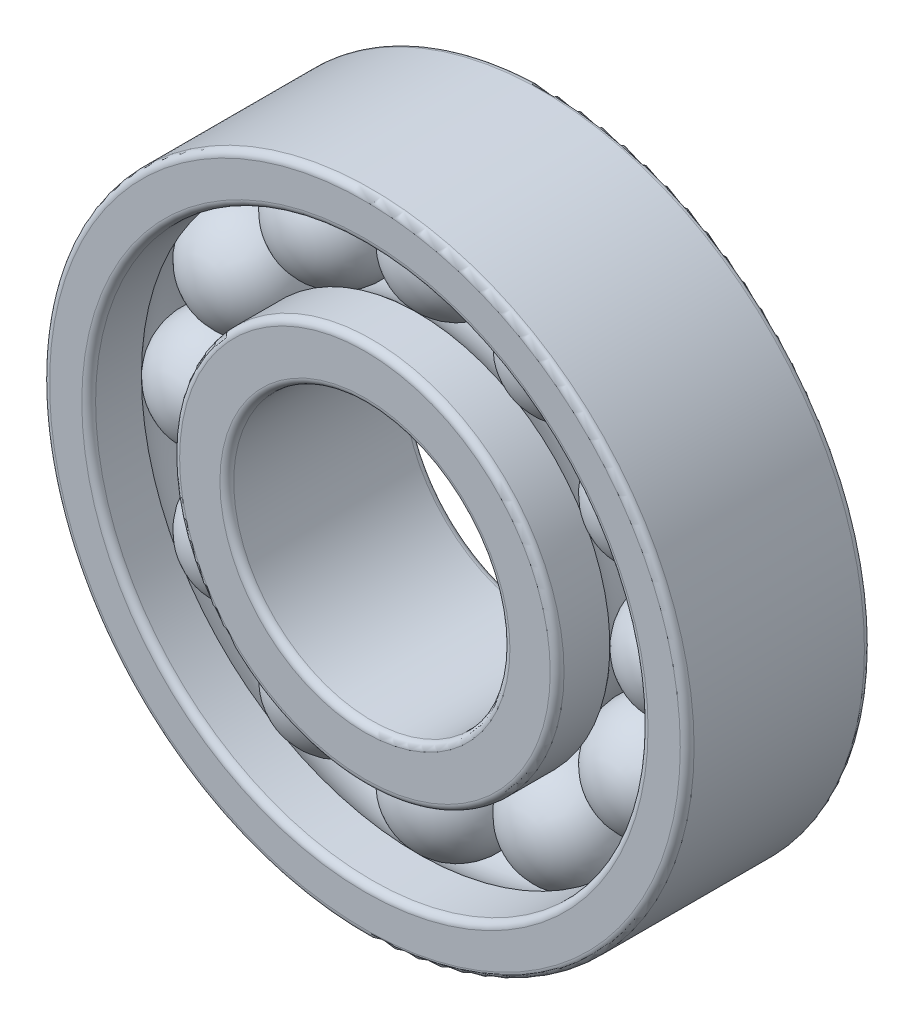
ISO-10303-21;
HEADER;
FILE_DESCRIPTION(('STEP AP214'),'2;1');
FILE_NAME('part.step','',(''),(''),'','','');
FILE_SCHEMA(('AUTOMOTIVE_DESIGN { 1 0 10303 214 1 1 1 1 }'));
ENDSEC;
DATA;
#1=APPLICATION_CONTEXT('core data for automotive mechanical design processes');
#2=APPLICATION_PROTOCOL_DEFINITION('international standard','automotive_design',2000,#1);
#3=PRODUCT_CONTEXT('',#1,'mechanical');
#4=PRODUCT('Part','Part','',(#3));
#5=PRODUCT_RELATED_PRODUCT_CATEGORY('part','',(#4));
#6=PRODUCT_DEFINITION_FORMATION('','',#4);
#7=PRODUCT_DEFINITION_CONTEXT('part definition',#1,'design');
#8=PRODUCT_DEFINITION('design','',#6,#7);
#9=PRODUCT_DEFINITION_SHAPE('','',#8);
#10=(LENGTH_UNIT() NAMED_UNIT(*) SI_UNIT(.MILLI.,.METRE.));
#11=(NAMED_UNIT(*) PLANE_ANGLE_UNIT() SI_UNIT($,.RADIAN.));
#12=(NAMED_UNIT(*) SI_UNIT($,.STERADIAN.) SOLID_ANGLE_UNIT());
#13=UNCERTAINTY_MEASURE_WITH_UNIT(LENGTH_MEASURE(1.E-05),#10,'distance_accuracy_value','');
#14=(GEOMETRIC_REPRESENTATION_CONTEXT(3) GLOBAL_UNCERTAINTY_ASSIGNED_CONTEXT((#13)) GLOBAL_UNIT_ASSIGNED_CONTEXT((#10,
#11,#12)) REPRESENTATION_CONTEXT('',''));
#15=CARTESIAN_POINT('',(0.,0.,0.));
#16=DIRECTION('',(0.,0.,1.));
#17=DIRECTION('',(1.,0.,0.));
#18=AXIS2_PLACEMENT_3D('',#15,#16,#17);
#19=CARTESIAN_POINT('',(-8.81180848350673,5.08749999999989,4.));
#20=DIRECTION('',(0.,0.,-1.));
#21=DIRECTION('',(0.866025403784445,-0.499999999999989,0.));
#22=AXIS2_PLACEMENT_3D('',#19,#20,#21);
#23=SPHERICAL_SURFACE('',#22,2.5);
#24=CARTESIAN_POINT('',(-8.81180848350673,5.08749999999989,1.5));
#25=VERTEX_POINT('',#24);
#26=VERTEX_LOOP('',#25);
#27=FACE_BOUND('',#26,.T.);
#28=ADVANCED_FACE('F76',(#27),#23,.T.);
#29=CLOSED_SHELL('',(#28));
#30=MANIFOLD_SOLID_BREP('B2',#29);
#31=CARTESIAN_POINT('',(-5.0875000000001,8.8118084835066,4.));
#32=DIRECTION('',(0.,0.,-1.));
#33=DIRECTION('',(0.50000000000001,-0.866025403784433,0.));
#34=AXIS2_PLACEMENT_3D('',#31,#32,#33);
#35=SPHERICAL_SURFACE('',#34,2.5);
#36=CARTESIAN_POINT('',(-5.0875000000001,8.8118084835066,1.5));
#37=VERTEX_POINT('',#36);
#38=VERTEX_LOOP('',#37);
#39=FACE_BOUND('',#38,.T.);
#40=ADVANCED_FACE('F95',(#39),#35,.T.);
#41=CLOSED_SHELL('',(#40));
#42=MANIFOLD_SOLID_BREP('B7',#41);
#43=CARTESIAN_POINT('',(-1.06577529597864E-13,10.175,4.));
#44=DIRECTION('',(0.,0.,-1.));
#45=DIRECTION('',(0.,-1.,0.));
#46=AXIS2_PLACEMENT_3D('',#43,#44,#45);
#47=SPHERICAL_SURFACE('',#46,2.5);
#48=CARTESIAN_POINT('',(-1.06577529597864E-13,10.175,1.5));
#49=VERTEX_POINT('',#48);
#50=VERTEX_LOOP('',#49);
#51=FACE_BOUND('',#50,.T.);
#52=ADVANCED_FACE('F114',(#51),#47,.T.);
#53=CLOSED_SHELL('',(#52));
#54=MANIFOLD_SOLID_BREP('B72',#53);
#55=CARTESIAN_POINT('',(5.08749999999992,8.81180848350671,4.));
#56=DIRECTION('',(0.,0.,-1.));
#57=DIRECTION('',(-0.499999999999992,-0.866025403784443,0.));
#58=AXIS2_PLACEMENT_3D('',#55,#56,#57);
#59=SPHERICAL_SURFACE('',#58,2.5);
#60=CARTESIAN_POINT('',(5.08749999999992,8.81180848350671,1.5));
#61=VERTEX_POINT('',#60);
#62=VERTEX_LOOP('',#61);
#63=FACE_BOUND('',#62,.T.);
#64=ADVANCED_FACE('F133',(#63),#59,.T.);
#65=CLOSED_SHELL('',(#64));
#66=MANIFOLD_SOLID_BREP('B91',#65);
#67=CARTESIAN_POINT('',(8.81180848350662,5.08750000000007,4.));
#68=DIRECTION('',(0.,0.,-1.));
#69=DIRECTION('',(-0.866025403784435,-0.500000000000007,0.));
#70=AXIS2_PLACEMENT_3D('',#67,#68,#69);
#71=SPHERICAL_SURFACE('',#70,2.5);
#72=CARTESIAN_POINT('',(8.81180848350662,5.08750000000007,1.5));
#73=VERTEX_POINT('',#72);
#74=VERTEX_LOOP('',#73);
#75=FACE_BOUND('',#74,.T.);
#76=ADVANCED_FACE('F152',(#75),#71,.T.);
#77=CLOSED_SHELL('',(#76));
#78=MANIFOLD_SOLID_BREP('B110',#77);
#79=CARTESIAN_POINT('',(10.175,0.,4.));
#80=DIRECTION('',(0.,0.,-1.));
#81=DIRECTION('',(-1.,0.,0.));
#82=AXIS2_PLACEMENT_3D('',#79,#80,#81);
#83=SPHERICAL_SURFACE('',#82,2.5);
#84=CARTESIAN_POINT('',(10.175,0.,1.5));
#85=VERTEX_POINT('',#84);
#86=VERTEX_LOOP('',#85);
#87=FACE_BOUND('',#86,.T.);
#88=ADVANCED_FACE('F171',(#87),#83,.T.);
#89=CLOSED_SHELL('',(#88));
#90=MANIFOLD_SOLID_BREP('B129',#89);
#91=CARTESIAN_POINT('',(8.81180848350669,-5.08749999999995,4.));
#92=DIRECTION('',(0.,0.,-1.));
#93=DIRECTION('',(-0.866025403784442,0.499999999999995,0.));
#94=AXIS2_PLACEMENT_3D('',#91,#92,#93);
#95=SPHERICAL_SURFACE('',#94,2.5);
#96=CARTESIAN_POINT('',(8.81180848350669,-5.08749999999995,1.5));
#97=VERTEX_POINT('',#96);
#98=VERTEX_LOOP('',#97);
#99=FACE_BOUND('',#98,.T.);
#100=ADVANCED_FACE('F190',(#99),#95,.T.);
#101=CLOSED_SHELL('',(#100));
#102=MANIFOLD_SOLID_BREP('B148',#101);
#103=CARTESIAN_POINT('',(5.08750000000004,-8.81180848350664,4.));
#104=DIRECTION('',(0.,0.,-1.));
#105=DIRECTION('',(-0.500000000000004,0.866025403784436,0.));
#106=AXIS2_PLACEMENT_3D('',#103,#104,#105);
#107=SPHERICAL_SURFACE('',#106,2.5);
#108=CARTESIAN_POINT('',(5.08750000000004,-8.81180848350664,1.5));
#109=VERTEX_POINT('',#108);
#110=VERTEX_LOOP('',#109);
#111=FACE_BOUND('',#110,.T.);
#112=ADVANCED_FACE('F209',(#111),#107,.T.);
#113=CLOSED_SHELL('',(#112));
#114=MANIFOLD_SOLID_BREP('B167',#113);
#115=CARTESIAN_POINT('',(0.,-10.175,4.));
#116=DIRECTION('',(0.,0.,-1.));
#117=DIRECTION('',(0.,1.,0.));
#118=AXIS2_PLACEMENT_3D('',#115,#116,#117);
#119=SPHERICAL_SURFACE('',#118,2.5);
#120=CARTESIAN_POINT('',(0.,-10.175,1.5));
#121=VERTEX_POINT('',#120);
#122=VERTEX_LOOP('',#121);
#123=FACE_BOUND('',#122,.T.);
#124=ADVANCED_FACE('F228',(#123),#119,.T.);
#125=CLOSED_SHELL('',(#124));
#126=MANIFOLD_SOLID_BREP('B186',#125);
#127=CARTESIAN_POINT('',(-5.08749999999998,-8.81180848350667,4.));
#128=DIRECTION('',(0.,0.,-1.));
#129=DIRECTION('',(0.499999999999998,0.86602540378444,0.));
#130=AXIS2_PLACEMENT_3D('',#127,#128,#129);
#131=SPHERICAL_SURFACE('',#130,2.5);
#132=CARTESIAN_POINT('',(-5.08749999999998,-8.81180848350667,1.5));
#133=VERTEX_POINT('',#132);
#134=VERTEX_LOOP('',#133);
#135=FACE_BOUND('',#134,.T.);
#136=ADVANCED_FACE('F247',(#135),#131,.T.);
#137=CLOSED_SHELL('',(#136));
#138=MANIFOLD_SOLID_BREP('B205',#137);
#139=CARTESIAN_POINT('',(-8.81180848350666,-5.08750000000001,4.));
#140=DIRECTION('',(0.,0.,-1.));
#141=DIRECTION('',(0.866025403784438,0.500000000000001,0.));
#142=AXIS2_PLACEMENT_3D('',#139,#140,#141);
#143=SPHERICAL_SURFACE('',#142,2.5);
#144=CARTESIAN_POINT('',(-8.81180848350666,-5.08750000000001,1.5));
#145=VERTEX_POINT('',#144);
#146=VERTEX_LOOP('',#145);
#147=FACE_BOUND('',#146,.T.);
#148=ADVANCED_FACE('F266',(#147),#143,.T.);
#149=CLOSED_SHELL('',(#148));
#150=MANIFOLD_SOLID_BREP('B224',#149);
#151=CARTESIAN_POINT('',(-10.175,0.,4.));
#152=DIRECTION('',(0.,0.,-1.));
#153=DIRECTION('',(1.,0.,0.));
#154=AXIS2_PLACEMENT_3D('',#151,#152,#153);
#155=SPHERICAL_SURFACE('',#154,2.5);
#156=CARTESIAN_POINT('',(-10.175,0.,1.5));
#157=VERTEX_POINT('',#156);
#158=VERTEX_LOOP('',#157);
#159=FACE_BOUND('',#158,.T.);
#160=ADVANCED_FACE('F287',(#159),#155,.T.);
#161=CLOSED_SHELL('',(#160));
#162=MANIFOLD_SOLID_BREP('B243',#161);
#163=CARTESIAN_POINT('',(0.,0.,8.));
#164=DIRECTION('',(0.,0.,-1.));
#165=DIRECTION('',(-1.,0.,0.));
#166=AXIS2_PLACEMENT_3D('',#163,#164,#165);
#167=CYLINDRICAL_SURFACE('',#166,8.35);
#168=CARTESIAN_POINT('',(0.,0.,0.3));
#169=DIRECTION('',(0.,0.,1.));
#170=DIRECTION('',(1.,0.,0.));
#171=AXIS2_PLACEMENT_3D('',#168,#169,#170);
#172=CIRCLE('',#171,8.35);
#173=CARTESIAN_POINT('',(8.35,0.,0.3));
#174=VERTEX_POINT('',#173);
#175=EDGE_CURVE('E286',#174,#174,#172,.T.);
#176=ORIENTED_EDGE('',*,*,#175,.T.);
#177=EDGE_LOOP('',(#176));
#178=FACE_BOUND('',#177,.T.);
#179=CARTESIAN_POINT('',(0.,0.,2.29138213751582));
#180=DIRECTION('',(0.,0.,1.));
#181=DIRECTION('',(1.,0.,0.));
#182=AXIS2_PLACEMENT_3D('',#179,#180,#181);
#183=CIRCLE('',#182,8.35);
#184=CARTESIAN_POINT('',(8.35,0.,2.29138213751582));
#185=VERTEX_POINT('',#184);
#186=EDGE_CURVE('E339',#185,#185,#183,.F.);
#187=ORIENTED_EDGE('',*,*,#186,.T.);
#188=EDGE_LOOP('',(#187));
#189=FACE_BOUND('',#188,.T.);
#190=ADVANCED_FACE('F307',(#178,#189),#167,.T.);
#191=CARTESIAN_POINT('',(0.,0.,8.));
#192=DIRECTION('',(0.,0.,1.));
#193=DIRECTION('',(1.,0.,0.));
#194=AXIS2_PLACEMENT_3D('',#191,#192,#193);
#195=PLANE('',#194);
#196=CARTESIAN_POINT('',(0.,0.,8.));
#197=DIRECTION('',(0.,0.,1.));
#198=DIRECTION('',(1.,0.,0.));
#199=AXIS2_PLACEMENT_3D('',#196,#197,#198);
#200=CIRCLE('',#199,6.3);
#201=CARTESIAN_POINT('',(6.3,0.,8.));
#202=VERTEX_POINT('',#201);
#203=EDGE_CURVE('E327',#202,#202,#200,.F.);
#204=ORIENTED_EDGE('',*,*,#203,.T.);
#205=EDGE_LOOP('',(#204));
#206=FACE_BOUND('',#205,.T.);
#207=CARTESIAN_POINT('',(0.,0.,8.));
#208=DIRECTION('',(0.,0.,1.));
#209=DIRECTION('',(1.,0.,0.));
#210=AXIS2_PLACEMENT_3D('',#207,#208,#209);
#211=CIRCLE('',#210,8.05);
#212=CARTESIAN_POINT('',(8.05,0.,8.));
#213=VERTEX_POINT('',#212);
#214=EDGE_CURVE('E330',#213,#213,#211,.T.);
#215=ORIENTED_EDGE('',*,*,#214,.T.);
#216=EDGE_LOOP('',(#215));
#217=FACE_BOUND('',#216,.T.);
#218=ADVANCED_FACE('F366',(#206,#217),#195,.T.);
#219=CARTESIAN_POINT('',(0.,0.,0.));
#220=DIRECTION('',(0.,0.,1.));
#221=DIRECTION('',(1.,0.,0.));
#222=AXIS2_PLACEMENT_3D('',#219,#220,#221);
#223=PLANE('',#222);
#224=CARTESIAN_POINT('',(0.,0.,0.));
#225=DIRECTION('',(0.,0.,1.));
#226=DIRECTION('',(1.,0.,0.));
#227=AXIS2_PLACEMENT_3D('',#224,#225,#226);
#228=CIRCLE('',#227,6.3);
#229=CARTESIAN_POINT('',(6.3,0.,0.));
#230=VERTEX_POINT('',#229);
#231=EDGE_CURVE('E314',#230,#230,#228,.T.);
#232=ORIENTED_EDGE('',*,*,#231,.T.);
#233=EDGE_LOOP('',(#232));
#234=FACE_BOUND('',#233,.T.);
#235=CARTESIAN_POINT('',(0.,0.,0.));
#236=DIRECTION('',(0.,0.,1.));
#237=DIRECTION('',(1.,0.,0.));
#238=AXIS2_PLACEMENT_3D('',#235,#236,#237);
#239=CIRCLE('',#238,8.05);
#240=CARTESIAN_POINT('',(8.05,0.,0.));
#241=VERTEX_POINT('',#240);
#242=EDGE_CURVE('E318',#241,#241,#239,.F.);
#243=ORIENTED_EDGE('',*,*,#242,.T.);
#244=EDGE_LOOP('',(#243));
#245=FACE_BOUND('',#244,.T.);
#246=ADVANCED_FACE('F370',(#234,#245),#223,.F.);
#247=CARTESIAN_POINT('',(0.,0.,7.7));
#248=DIRECTION('',(0.,0.,1.));
#249=DIRECTION('',(1.,0.,0.));
#250=AXIS2_PLACEMENT_3D('',#247,#248,#249);
#251=CIRCLE('',#250,8.35);
#252=CARTESIAN_POINT('',(8.35,0.,7.7));
#253=VERTEX_POINT('',#252);
#254=EDGE_CURVE('E322',#253,#253,#251,.F.);
#255=ORIENTED_EDGE('',*,*,#254,.T.);
#256=EDGE_LOOP('',(#255));
#257=FACE_BOUND('',#256,.T.);
#258=CARTESIAN_POINT('',(0.,0.,5.70861786248418));
#259=DIRECTION('',(0.,0.,-1.));
#260=DIRECTION('',(-1.,0.,0.));
#261=AXIS2_PLACEMENT_3D('',#258,#259,#260);
#262=CIRCLE('',#261,8.35);
#263=CARTESIAN_POINT('',(-8.35,0.,5.70861786248418));
#264=VERTEX_POINT('',#263);
#265=EDGE_CURVE('E342',#264,#264,#262,.F.);
#266=ORIENTED_EDGE('',*,*,#265,.T.);
#267=EDGE_LOOP('',(#266));
#268=FACE_BOUND('',#267,.T.);
#269=ADVANCED_FACE('F346',(#257,#268),#167,.T.);
#270=CARTESIAN_POINT('',(0.,0.,8.));
#271=DIRECTION('',(0.,0.,-1.));
#272=DIRECTION('',(-1.,0.,0.));
#273=AXIS2_PLACEMENT_3D('',#270,#271,#272);
#274=CYLINDRICAL_SURFACE('',#273,6.);
#275=CARTESIAN_POINT('',(0.,0.,7.7));
#276=DIRECTION('',(0.,0.,1.));
#277=DIRECTION('',(1.,0.,0.));
#278=AXIS2_PLACEMENT_3D('',#275,#276,#277);
#279=CIRCLE('',#278,6.);
#280=CARTESIAN_POINT('',(6.,0.,7.7));
#281=VERTEX_POINT('',#280);
#282=EDGE_CURVE('E333',#281,#281,#279,.T.);
#283=ORIENTED_EDGE('',*,*,#282,.T.);
#284=EDGE_LOOP('',(#283));
#285=FACE_BOUND('',#284,.T.);
#286=CARTESIAN_POINT('',(0.,0.,0.3));
#287=DIRECTION('',(0.,0.,1.));
#288=DIRECTION('',(1.,0.,0.));
#289=AXIS2_PLACEMENT_3D('',#286,#287,#288);
#290=CIRCLE('',#289,6.);
#291=CARTESIAN_POINT('',(6.,0.,0.3));
#292=VERTEX_POINT('',#291);
#293=EDGE_CURVE('E336',#292,#292,#290,.F.);
#294=ORIENTED_EDGE('',*,*,#293,.T.);
#295=EDGE_LOOP('',(#294));
#296=FACE_BOUND('',#295,.T.);
#297=ADVANCED_FACE('F351',(#285,#296),#274,.F.);
#298=CARTESIAN_POINT('',(0.,0.,4.));
#299=DIRECTION('',(0.,0.,-1.));
#300=DIRECTION('',(-1.,0.,0.));
#301=AXIS2_PLACEMENT_3D('',#298,#299,#300);
#302=TOROIDAL_SURFACE('',#301,10.175,2.5);
#303=ORIENTED_EDGE('',*,*,#186,.F.);
#304=EDGE_LOOP('',(#303));
#305=FACE_BOUND('',#304,.T.);
#306=ORIENTED_EDGE('',*,*,#265,.F.);
#307=EDGE_LOOP('',(#306));
#308=FACE_BOUND('',#307,.T.);
#309=ADVANCED_FACE('F348',(#305,#308),#302,.F.);
#310=CARTESIAN_POINT('',(0.,0.,7.7));
#311=DIRECTION('',(0.,0.,1.));
#312=DIRECTION('',(1.,0.,0.));
#313=AXIS2_PLACEMENT_3D('',#310,#311,#312);
#314=TOROIDAL_SURFACE('',#313,6.3,0.3);
#315=ORIENTED_EDGE('',*,*,#203,.F.);
#316=EDGE_LOOP('',(#315));
#317=FACE_BOUND('',#316,.T.);
#318=ORIENTED_EDGE('',*,*,#282,.F.);
#319=EDGE_LOOP('',(#318));
#320=FACE_BOUND('',#319,.T.);
#321=ADVANCED_FACE('F350',(#317,#320),#314,.T.);
#322=CARTESIAN_POINT('',(0.,0.,7.7));
#323=DIRECTION('',(0.,0.,1.));
#324=DIRECTION('',(1.,0.,0.));
#325=AXIS2_PLACEMENT_3D('',#322,#323,#324);
#326=TOROIDAL_SURFACE('',#325,8.05,0.3);
#327=ORIENTED_EDGE('',*,*,#254,.F.);
#328=EDGE_LOOP('',(#327));
#329=FACE_BOUND('',#328,.T.);
#330=ORIENTED_EDGE('',*,*,#214,.F.);
#331=EDGE_LOOP('',(#330));
#332=FACE_BOUND('',#331,.T.);
#333=ADVANCED_FACE('F358',(#329,#332),#326,.T.);
#334=CARTESIAN_POINT('',(0.,0.,0.3));
#335=DIRECTION('',(0.,0.,1.));
#336=DIRECTION('',(1.,0.,0.));
#337=AXIS2_PLACEMENT_3D('',#334,#335,#336);
#338=TOROIDAL_SURFACE('',#337,6.3,0.3);
#339=ORIENTED_EDGE('',*,*,#293,.F.);
#340=EDGE_LOOP('',(#339));
#341=FACE_BOUND('',#340,.T.);
#342=ORIENTED_EDGE('',*,*,#231,.F.);
#343=EDGE_LOOP('',(#342));
#344=FACE_BOUND('',#343,.T.);
#345=ADVANCED_FACE('F384',(#341,#344),#338,.T.);
#346=CARTESIAN_POINT('',(0.,0.,0.3));
#347=DIRECTION('',(0.,0.,1.));
#348=DIRECTION('',(1.,0.,0.));
#349=AXIS2_PLACEMENT_3D('',#346,#347,#348);
#350=TOROIDAL_SURFACE('',#349,8.05,0.3);
#351=ORIENTED_EDGE('',*,*,#242,.F.);
#352=EDGE_LOOP('',(#351));
#353=FACE_BOUND('',#352,.T.);
#354=ORIENTED_EDGE('',*,*,#175,.F.);
#355=EDGE_LOOP('',(#354));
#356=FACE_BOUND('',#355,.T.);
#357=ADVANCED_FACE('F309',(#353,#356),#350,.T.);
#358=CLOSED_SHELL('',(#190,#218,#246,#269,#297,#309,#321,#333,#345,#357));
#359=MANIFOLD_SOLID_BREP('B262',#358);
#360=CARTESIAN_POINT('',(0.,0.,8.));
#361=DIRECTION('',(0.,0.,-1.));
#362=DIRECTION('',(-1.,0.,0.));
#363=AXIS2_PLACEMENT_3D('',#360,#361,#362);
#364=CYLINDRICAL_SURFACE('',#363,12.);
#365=CARTESIAN_POINT('',(0.,0.,0.3));
#366=DIRECTION('',(0.,0.,1.));
#367=DIRECTION('',(1.,0.,0.));
#368=AXIS2_PLACEMENT_3D('',#365,#366,#367);
#369=CIRCLE('',#368,12.);
#370=CARTESIAN_POINT('',(12.,0.,0.3));
#371=VERTEX_POINT('',#370);
#372=EDGE_CURVE('E481',#371,#371,#369,.F.);
#373=ORIENTED_EDGE('',*,*,#372,.T.);
#374=EDGE_LOOP('',(#373));
#375=FACE_BOUND('',#374,.T.);
#376=CARTESIAN_POINT('',(0.,0.,2.29138213751582));
#377=DIRECTION('',(0.,0.,1.));
#378=DIRECTION('',(1.,0.,0.));
#379=AXIS2_PLACEMENT_3D('',#376,#377,#378);
#380=CIRCLE('',#379,12.);
#381=CARTESIAN_POINT('',(12.,0.,2.29138213751582));
#382=VERTEX_POINT('',#381);
#383=EDGE_CURVE('E490',#382,#382,#380,.F.);
#384=ORIENTED_EDGE('',*,*,#383,.F.);
#385=EDGE_LOOP('',(#384));
#386=FACE_BOUND('',#385,.T.);
#387=ADVANCED_FACE('F458',(#375,#386),#364,.F.);
#388=CARTESIAN_POINT('',(0.,0.,8.));
#389=DIRECTION('',(0.,0.,1.));
#390=DIRECTION('',(1.,0.,0.));
#391=AXIS2_PLACEMENT_3D('',#388,#389,#390);
#392=PLANE('',#391);
#393=CARTESIAN_POINT('',(0.,0.,8.));
#394=DIRECTION('',(0.,0.,1.));
#395=DIRECTION('',(1.,0.,0.));
#396=AXIS2_PLACEMENT_3D('',#393,#394,#395);
#397=CIRCLE('',#396,12.3);
#398=CARTESIAN_POINT('',(12.3,0.,8.));
#399=VERTEX_POINT('',#398);
#400=EDGE_CURVE('E306',#399,#399,#397,.F.);
#401=ORIENTED_EDGE('',*,*,#400,.T.);
#402=EDGE_LOOP('',(#401));
#403=FACE_BOUND('',#402,.T.);
#404=CARTESIAN_POINT('',(0.,0.,8.));
#405=DIRECTION('',(0.,0.,1.));
#406=DIRECTION('',(1.,0.,0.));
#407=AXIS2_PLACEMENT_3D('',#404,#405,#406);
#408=CIRCLE('',#407,13.7);
#409=CARTESIAN_POINT('',(13.7,0.,8.));
#410=VERTEX_POINT('',#409);
#411=EDGE_CURVE('E465',#410,#410,#408,.T.);
#412=ORIENTED_EDGE('',*,*,#411,.T.);
#413=EDGE_LOOP('',(#412));
#414=FACE_BOUND('',#413,.T.);
#415=ADVANCED_FACE('F516',(#403,#414),#392,.T.);
#416=CARTESIAN_POINT('',(0.,0.,0.));
#417=DIRECTION('',(0.,0.,1.));
#418=DIRECTION('',(1.,0.,0.));
#419=AXIS2_PLACEMENT_3D('',#416,#417,#418);
#420=PLANE('',#419);
#421=CARTESIAN_POINT('',(0.,0.,0.));
#422=DIRECTION('',(0.,0.,1.));
#423=DIRECTION('',(1.,0.,0.));
#424=AXIS2_PLACEMENT_3D('',#421,#422,#423);
#425=CIRCLE('',#424,12.3);
#426=CARTESIAN_POINT('',(12.3,0.,0.));
#427=VERTEX_POINT('',#426);
#428=EDGE_CURVE('E484',#427,#427,#425,.T.);
#429=ORIENTED_EDGE('',*,*,#428,.T.);
#430=EDGE_LOOP('',(#429));
#431=FACE_BOUND('',#430,.T.);
#432=CARTESIAN_POINT('',(0.,0.,0.));
#433=DIRECTION('',(0.,0.,1.));
#434=DIRECTION('',(1.,0.,0.));
#435=AXIS2_PLACEMENT_3D('',#432,#433,#434);
#436=CIRCLE('',#435,13.7);
#437=CARTESIAN_POINT('',(13.7,0.,0.));
#438=VERTEX_POINT('',#437);
#439=EDGE_CURVE('E487',#438,#438,#436,.F.);
#440=ORIENTED_EDGE('',*,*,#439,.T.);
#441=EDGE_LOOP('',(#440));
#442=FACE_BOUND('',#441,.T.);
#443=ADVANCED_FACE('F511',(#431,#442),#420,.F.);
#444=CARTESIAN_POINT('',(0.,0.,8.));
#445=DIRECTION('',(0.,0.,-1.));
#446=DIRECTION('',(-1.,0.,0.));
#447=AXIS2_PLACEMENT_3D('',#444,#445,#446);
#448=CYLINDRICAL_SURFACE('',#447,14.);
#449=CARTESIAN_POINT('',(0.,0.,0.3));
#450=DIRECTION('',(0.,0.,1.));
#451=DIRECTION('',(1.,0.,0.));
#452=AXIS2_PLACEMENT_3D('',#449,#450,#451);
#453=CIRCLE('',#452,14.);
#454=CARTESIAN_POINT('',(14.,0.,0.3));
#455=VERTEX_POINT('',#454);
#456=EDGE_CURVE('E473',#455,#455,#453,.T.);
#457=ORIENTED_EDGE('',*,*,#456,.T.);
#458=EDGE_LOOP('',(#457));
#459=FACE_BOUND('',#458,.T.);
#460=CARTESIAN_POINT('',(0.,0.,7.7));
#461=DIRECTION('',(0.,0.,1.));
#462=DIRECTION('',(1.,0.,0.));
#463=AXIS2_PLACEMENT_3D('',#460,#461,#462);
#464=CIRCLE('',#463,14.);
#465=CARTESIAN_POINT('',(14.,0.,7.7));
#466=VERTEX_POINT('',#465);
#467=EDGE_CURVE('E478',#466,#466,#464,.F.);
#468=ORIENTED_EDGE('',*,*,#467,.T.);
#469=EDGE_LOOP('',(#468));
#470=FACE_BOUND('',#469,.T.);
#471=ADVANCED_FACE('F502',(#459,#470),#448,.T.);
#472=CARTESIAN_POINT('',(0.,0.,7.7));
#473=DIRECTION('',(0.,0.,1.));
#474=DIRECTION('',(1.,0.,0.));
#475=AXIS2_PLACEMENT_3D('',#472,#473,#474);
#476=CIRCLE('',#475,12.);
#477=CARTESIAN_POINT('',(12.,0.,7.7));
#478=VERTEX_POINT('',#477);
#479=EDGE_CURVE('E469',#478,#478,#476,.T.);
#480=ORIENTED_EDGE('',*,*,#479,.T.);
#481=EDGE_LOOP('',(#480));
#482=FACE_BOUND('',#481,.T.);
#483=CARTESIAN_POINT('',(0.,0.,5.70861786248418));
#484=DIRECTION('',(0.,0.,-1.));
#485=DIRECTION('',(-1.,0.,0.));
#486=AXIS2_PLACEMENT_3D('',#483,#484,#485);
#487=CIRCLE('',#486,12.);
#488=CARTESIAN_POINT('',(-12.,0.,5.70861786248418));
#489=VERTEX_POINT('',#488);
#490=EDGE_CURVE('E493',#489,#489,#487,.F.);
#491=ORIENTED_EDGE('',*,*,#490,.F.);
#492=EDGE_LOOP('',(#491));
#493=FACE_BOUND('',#492,.T.);
#494=ADVANCED_FACE('F500',(#482,#493),#364,.F.);
#495=CARTESIAN_POINT('',(0.,0.,4.));
#496=DIRECTION('',(0.,0.,-1.));
#497=DIRECTION('',(-1.,0.,0.));
#498=AXIS2_PLACEMENT_3D('',#495,#496,#497);
#499=TOROIDAL_SURFACE('',#498,10.175,2.5);
#500=ORIENTED_EDGE('',*,*,#490,.T.);
#501=EDGE_LOOP('',(#500));
#502=FACE_BOUND('',#501,.T.);
#503=ORIENTED_EDGE('',*,*,#383,.T.);
#504=EDGE_LOOP('',(#503));
#505=FACE_BOUND('',#504,.T.);
#506=ADVANCED_FACE('F497',(#502,#505),#499,.F.);
#507=CARTESIAN_POINT('',(0.,0.,0.3));
#508=DIRECTION('',(0.,0.,1.));
#509=DIRECTION('',(1.,0.,0.));
#510=AXIS2_PLACEMENT_3D('',#507,#508,#509);
#511=TOROIDAL_SURFACE('',#510,12.3,0.3);
#512=ORIENTED_EDGE('',*,*,#372,.F.);
#513=EDGE_LOOP('',(#512));
#514=FACE_BOUND('',#513,.T.);
#515=ORIENTED_EDGE('',*,*,#428,.F.);
#516=EDGE_LOOP('',(#515));
#517=FACE_BOUND('',#516,.T.);
#518=ADVANCED_FACE('F509',(#514,#517),#511,.T.);
#519=CARTESIAN_POINT('',(0.,0.,0.3));
#520=DIRECTION('',(0.,0.,1.));
#521=DIRECTION('',(1.,0.,0.));
#522=AXIS2_PLACEMENT_3D('',#519,#520,#521);
#523=TOROIDAL_SURFACE('',#522,13.7,0.3);
#524=ORIENTED_EDGE('',*,*,#439,.F.);
#525=EDGE_LOOP('',(#524));
#526=FACE_BOUND('',#525,.T.);
#527=ORIENTED_EDGE('',*,*,#456,.F.);
#528=EDGE_LOOP('',(#527));
#529=FACE_BOUND('',#528,.T.);
#530=ADVANCED_FACE('F527',(#526,#529),#523,.T.);
#531=CARTESIAN_POINT('',(0.,0.,7.7));
#532=DIRECTION('',(0.,0.,1.));
#533=DIRECTION('',(1.,0.,0.));
#534=AXIS2_PLACEMENT_3D('',#531,#532,#533);
#535=TOROIDAL_SURFACE('',#534,12.3,0.3);
#536=ORIENTED_EDGE('',*,*,#400,.F.);
#537=EDGE_LOOP('',(#536));
#538=FACE_BOUND('',#537,.T.);
#539=ORIENTED_EDGE('',*,*,#479,.F.);
#540=EDGE_LOOP('',(#539));
#541=FACE_BOUND('',#540,.T.);
#542=ADVANCED_FACE('F538',(#538,#541),#535,.T.);
#543=CARTESIAN_POINT('',(0.,0.,7.7));
#544=DIRECTION('',(0.,0.,1.));
#545=DIRECTION('',(1.,0.,0.));
#546=AXIS2_PLACEMENT_3D('',#543,#544,#545);
#547=TOROIDAL_SURFACE('',#546,13.7,0.3);
#548=ORIENTED_EDGE('',*,*,#467,.F.);
#549=EDGE_LOOP('',(#548));
#550=FACE_BOUND('',#549,.T.);
#551=ORIENTED_EDGE('',*,*,#411,.F.);
#552=EDGE_LOOP('',(#551));
#553=FACE_BOUND('',#552,.T.);
#554=ADVANCED_FACE('F460',(#550,#553),#547,.T.);
#555=CLOSED_SHELL('',(#387,#415,#443,#471,#494,#506,#518,#530,#542,#554));
#556=MANIFOLD_SOLID_BREP('B281',#555);
#557=ADVANCED_BREP_SHAPE_REPRESENTATION('',(#18,#30,#42,#54,#66,#78,#90,#102,#114,#126,#138,
#150,#162,#359,#556),#14);
#558=SHAPE_DEFINITION_REPRESENTATION(#9,#557);
ENDSEC;
END-ISO-10303-21;
